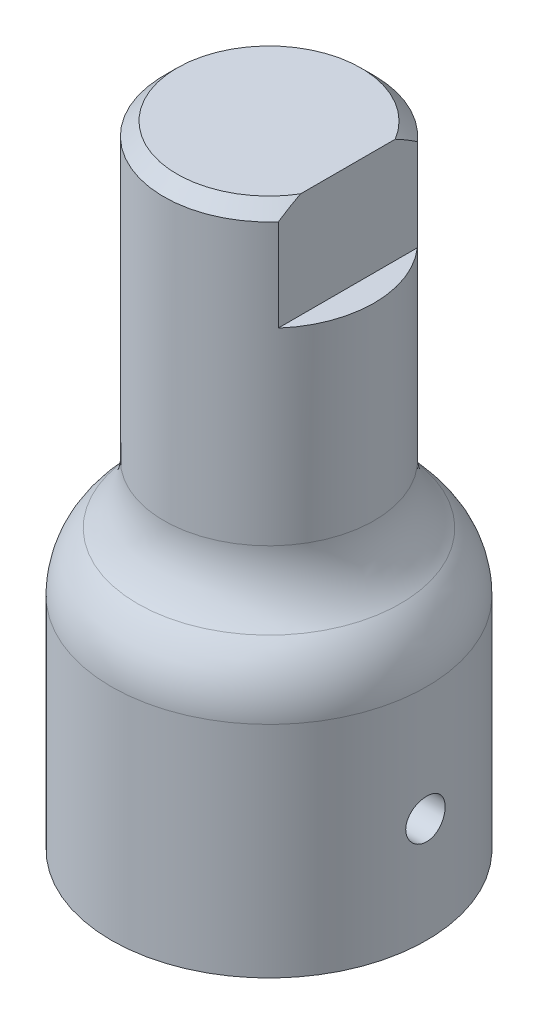
ISO-10303-21;
HEADER;
FILE_DESCRIPTION(('STEP AP214'),'2;1');
FILE_NAME('part.step','',(''),(''),'','','');
FILE_SCHEMA(('AUTOMOTIVE_DESIGN { 1 0 10303 214 1 1 1 1 }'));
ENDSEC;
DATA;
#1=APPLICATION_CONTEXT('core data for automotive mechanical design processes');
#2=APPLICATION_PROTOCOL_DEFINITION('international standard','automotive_design',2000,#1);
#3=PRODUCT_CONTEXT('',#1,'mechanical');
#4=PRODUCT('Part','Part','',(#3));
#5=PRODUCT_RELATED_PRODUCT_CATEGORY('part','',(#4));
#6=PRODUCT_DEFINITION_FORMATION('','',#4);
#7=PRODUCT_DEFINITION_CONTEXT('part definition',#1,'design');
#8=PRODUCT_DEFINITION('design','',#6,#7);
#9=PRODUCT_DEFINITION_SHAPE('','',#8);
#10=(LENGTH_UNIT() NAMED_UNIT(*) SI_UNIT(.MILLI.,.METRE.));
#11=(NAMED_UNIT(*) PLANE_ANGLE_UNIT() SI_UNIT($,.RADIAN.));
#12=(NAMED_UNIT(*) SI_UNIT($,.STERADIAN.) SOLID_ANGLE_UNIT());
#13=UNCERTAINTY_MEASURE_WITH_UNIT(LENGTH_MEASURE(1.E-05),#10,'distance_accuracy_value','');
#14=(GEOMETRIC_REPRESENTATION_CONTEXT(3) GLOBAL_UNCERTAINTY_ASSIGNED_CONTEXT((#13)) GLOBAL_UNIT_ASSIGNED_CONTEXT((#10,
#11,#12)) REPRESENTATION_CONTEXT('',''));
#15=CARTESIAN_POINT('',(0.,0.,0.));
#16=DIRECTION('',(0.,0.,1.));
#17=DIRECTION('',(1.,0.,0.));
#18=AXIS2_PLACEMENT_3D('',#15,#16,#17);
#19=CARTESIAN_POINT('',(0.,38.1,0.));
#20=DIRECTION('',(0.,-1.,0.));
#21=DIRECTION('',(0.,0.,-1.));
#22=AXIS2_PLACEMENT_3D('',#19,#20,#21);
#23=CYLINDRICAL_SURFACE('',#22,6.35);
#24=CARTESIAN_POINT('',(0.,20.3651280605346,0.));
#25=DIRECTION('',(0.,-1.,0.));
#26=DIRECTION('',(0.,0.,-1.));
#27=AXIS2_PLACEMENT_3D('',#24,#25,#26);
#28=CIRCLE('',#27,6.35);
#29=CARTESIAN_POINT('',(0.,20.3651280605346,-6.35));
#30=VERTEX_POINT('',#29);
#31=EDGE_CURVE('E151',#30,#30,#28,.F.);
#32=ORIENTED_EDGE('',*,*,#31,.T.);
#33=EDGE_LOOP('',(#32));
#34=FACE_BOUND('',#33,.T.);
#35=DIRECTION('',(0.,1.,0.));
#36=VECTOR('',#35,1.);
#37=CARTESIAN_POINT('',(4.7625,31.75,4.20013020631504));
#38=LINE('',#37,#36);
#39=CARTESIAN_POINT('',(4.7625,31.75,4.20013020631504));
#40=VERTEX_POINT('',#39);
#41=CARTESIAN_POINT('',(4.7625,37.30625,4.20013020631504));
#42=VERTEX_POINT('',#41);
#43=EDGE_CURVE('E84',#40,#42,#38,.T.);
#44=ORIENTED_EDGE('',*,*,#43,.T.);
#45=CARTESIAN_POINT('',(0.,37.30625,0.));
#46=DIRECTION('',(0.,1.,0.));
#47=DIRECTION('',(0.,0.,1.));
#48=AXIS2_PLACEMENT_3D('',#45,#46,#47);
#49=CIRCLE('',#48,6.35);
#50=CARTESIAN_POINT('',(4.76249999999999,37.30625,-4.20013020631504));
#51=VERTEX_POINT('',#50);
#52=EDGE_CURVE('E11',#42,#51,#49,.F.);
#53=ORIENTED_EDGE('',*,*,#52,.T.);
#54=DIRECTION('',(0.,1.,0.));
#55=VECTOR('',#54,1.);
#56=CARTESIAN_POINT('',(4.7625,31.75,-4.20013020631504));
#57=LINE('',#56,#55);
#58=CARTESIAN_POINT('',(4.7625,31.75,-4.20013020631504));
#59=VERTEX_POINT('',#58);
#60=EDGE_CURVE('E82',#59,#51,#57,.T.);
#61=ORIENTED_EDGE('',*,*,#60,.F.);
#62=CARTESIAN_POINT('',(0.,31.75,0.));
#63=DIRECTION('',(0.,1.,0.));
#64=DIRECTION('',(0.,0.,1.));
#65=AXIS2_PLACEMENT_3D('',#62,#63,#64);
#66=CIRCLE('',#65,6.35);
#67=EDGE_CURVE('E87',#40,#59,#66,.T.);
#68=ORIENTED_EDGE('',*,*,#67,.F.);
#69=EDGE_LOOP('',(#44,#53,#61,#68));
#70=FACE_BOUND('',#69,.T.);
#71=ADVANCED_FACE('F37',(#34,#70),#23,.T.);
#72=CARTESIAN_POINT('',(0.,38.1,0.));
#73=DIRECTION('',(0.,1.,0.));
#74=DIRECTION('',(0.,0.,1.));
#75=AXIS2_PLACEMENT_3D('',#72,#73,#74);
#76=PLANE('',#75);
#77=DIRECTION('',(0.,0.,-1.));
#78=VECTOR('',#77,1.);
#79=CARTESIAN_POINT('',(4.7625,38.1,4.20013020631504));
#80=LINE('',#79,#78);
#81=CARTESIAN_POINT('',(4.7625,38.1,2.86190632489951));
#82=VERTEX_POINT('',#81);
#83=CARTESIAN_POINT('',(4.7625,38.1,-2.86190632489954));
#84=VERTEX_POINT('',#83);
#85=EDGE_CURVE('E90',#82,#84,#80,.T.);
#86=ORIENTED_EDGE('',*,*,#85,.T.);
#87=CARTESIAN_POINT('',(0.,38.1,0.));
#88=DIRECTION('',(0.,1.,0.));
#89=DIRECTION('',(0.,0.,1.));
#90=AXIS2_PLACEMENT_3D('',#87,#88,#89);
#91=CIRCLE('',#90,5.55624999999999);
#92=EDGE_CURVE('E167',#84,#82,#91,.T.);
#93=ORIENTED_EDGE('',*,*,#92,.T.);
#94=EDGE_LOOP('',(#86,#93));
#95=FACE_BOUND('',#94,.T.);
#96=ADVANCED_FACE('F143',(#95),#76,.T.);
#97=CARTESIAN_POINT('',(0.,0.,0.));
#98=DIRECTION('',(0.,1.,0.));
#99=DIRECTION('',(0.,0.,1.));
#100=AXIS2_PLACEMENT_3D('',#97,#98,#99);
#101=PLANE('',#100);
#102=CARTESIAN_POINT('',(0.,0.,0.));
#103=DIRECTION('',(0.,1.,0.));
#104=DIRECTION('',(0.,0.,1.));
#105=AXIS2_PLACEMENT_3D('',#102,#103,#104);
#106=CIRCLE('',#105,9.525);
#107=CARTESIAN_POINT('',(0.,0.,9.525));
#108=VERTEX_POINT('',#107);
#109=EDGE_CURVE('E154',#108,#108,#106,.T.);
#110=ORIENTED_EDGE('',*,*,#109,.F.);
#111=EDGE_LOOP('',(#110));
#112=FACE_BOUND('',#111,.T.);
#113=CARTESIAN_POINT('',(0.,0.,0.));
#114=DIRECTION('',(0.,1.,0.));
#115=DIRECTION('',(0.,0.,1.));
#116=AXIS2_PLACEMENT_3D('',#113,#114,#115);
#117=CIRCLE('',#116,6.35);
#118=CARTESIAN_POINT('',(4.76250000000001,0.,-4.20013020631506));
#119=VERTEX_POINT('',#118);
#120=CARTESIAN_POINT('',(4.7625,0.,4.20013020631504));
#121=VERTEX_POINT('',#120);
#122=EDGE_CURVE('E105',#119,#121,#117,.T.);
#123=ORIENTED_EDGE('',*,*,#122,.T.);
#124=DIRECTION('',(0.,0.,-1.));
#125=VECTOR('',#124,1.);
#126=CARTESIAN_POINT('',(4.7625,0.,4.20013020631504));
#127=LINE('',#126,#125);
#128=EDGE_CURVE('E241',#121,#119,#127,.T.);
#129=ORIENTED_EDGE('',*,*,#128,.T.);
#130=EDGE_LOOP('',(#123,#129));
#131=FACE_BOUND('',#130,.T.);
#132=ADVANCED_FACE('F140',(#112,#131),#101,.F.);
#133=CARTESIAN_POINT('',(0.,15.875,0.));
#134=DIRECTION('',(0.,-1.,0.));
#135=DIRECTION('',(0.,0.,-1.));
#136=AXIS2_PLACEMENT_3D('',#133,#134,#135);
#137=CYLINDRICAL_SURFACE('',#136,9.525);
#138=CARTESIAN_POINT('',(9.52500000000001,5.15937499999999,0.));
#139=CARTESIAN_POINT('',(9.52499907081925,5.15937782937063,0.0665993217584231));
#140=CARTESIAN_POINT('',(9.52429412394272,5.16498183370436,0.133240259761677));
#141=CARTESIAN_POINT('',(9.52154975978035,5.18724884311434,0.264667746995242));
#142=CARTESIAN_POINT('',(9.51950894913981,5.20392339543602,0.329452286209556));
#143=CARTESIAN_POINT('',(9.51432276572399,5.2478325529141,0.455245267504717));
#144=CARTESIAN_POINT('',(9.51117813655702,5.27506005016195,0.516256219269601));
#145=CARTESIAN_POINT('',(9.50413406293194,5.33928666899061,0.632831224917814));
#146=CARTESIAN_POINT('',(9.50023474798811,5.37628411431275,0.688396210941228));
#147=CARTESIAN_POINT('',(9.49209265522138,5.45921816611111,0.792819479063542));
#148=CARTESIAN_POINT('',(9.48784828372264,5.50519780785115,0.841643461301304));
#149=CARTESIAN_POINT('',(9.47950729512144,5.60469866970933,0.930903392931754));
#150=CARTESIAN_POINT('',(9.47541068555933,5.65822027401493,0.971338914756813));
#151=CARTESIAN_POINT('',(9.46781335551327,5.77150863931565,1.04280183931148));
#152=CARTESIAN_POINT('',(9.4643146875598,5.83129581844674,1.07379711069193));
#153=CARTESIAN_POINT('',(9.45833037427971,5.95527783348994,1.12529449021889));
#154=CARTESIAN_POINT('',(9.45584469053881,6.01947250215377,1.14579699627856));
#155=CARTESIAN_POINT('',(9.45218299236221,6.1500912981482,1.17562263923679));
#156=CARTESIAN_POINT('',(9.4510001961175,6.21650200898162,1.18500368539096));
#157=CARTESIAN_POINT('',(9.45005743403005,6.34996488297846,1.19249930547662));
#158=CARTESIAN_POINT('',(9.45029741096968,6.41701702023827,1.1906143324774));
#159=CARTESIAN_POINT('',(9.45216687494844,6.54945579897722,1.17567895885832));
#160=CARTESIAN_POINT('',(9.45378842328606,6.61484976217787,1.16269234837145));
#161=CARTESIAN_POINT('',(9.45822593884571,6.74252287885554,1.12602186999044));
#162=CARTESIAN_POINT('',(9.46104193026777,6.80480196919507,1.10233778535935));
#163=CARTESIAN_POINT('',(9.46756003930541,6.92467563453408,1.04487609790793));
#164=CARTESIAN_POINT('',(9.4712645849195,6.98225678424357,1.01107077457825));
#165=CARTESIAN_POINT('',(9.47914051318822,7.09095293821431,0.934346049828843));
#166=CARTESIAN_POINT('',(9.48331191719173,7.14206764654497,0.891426231533467));
#167=CARTESIAN_POINT('',(9.49168683585316,7.23675021598171,0.797337326496488));
#168=CARTESIAN_POINT('',(9.49589037311757,7.28026345495354,0.746113256233798));
#169=CARTESIAN_POINT('',(9.50382893754725,7.35808260411454,0.637059226790497));
#170=CARTESIAN_POINT('',(9.50756396363217,7.39238849307254,0.579229252377816));
#171=CARTESIAN_POINT('',(9.51414698744099,7.45081916637094,0.45856287098686));
#172=CARTESIAN_POINT('',(9.51699468708732,7.47494053041093,0.395724790529586));
#173=CARTESIAN_POINT('',(9.52147949227755,7.51227407254044,0.266846656630284));
#174=CARTESIAN_POINT('',(9.52311665449634,7.52548676135526,0.200806753245347));
#175=CARTESIAN_POINT('',(9.52498855290626,7.54055709830408,0.0678718943137941));
#176=CARTESIAN_POINT('',(9.5252325821293,7.54248999136338,0.000985594707077859));
#177=CARTESIAN_POINT('',(9.52431580975086,7.53514444165585,-0.132157487381941));
#178=CARTESIAN_POINT('',(9.52315503806675,7.52586623764643,-0.1984142832402));
#179=CARTESIAN_POINT('',(9.51956488620376,7.4964243761962,-0.328195546802384));
#180=CARTESIAN_POINT('',(9.51713968812605,7.47629659642949,-0.391728279164775));
#181=CARTESIAN_POINT('',(9.51129220626469,7.42576423852647,-0.514516523126327));
#182=CARTESIAN_POINT('',(9.50786988862573,7.39535931144345,-0.573771889410369));
#183=CARTESIAN_POINT('',(9.50038655660942,7.32495369326207,-0.686659402977398));
#184=CARTESIAN_POINT('',(9.49632233975245,7.28490432948006,-0.740260978173252));
#185=CARTESIAN_POINT('',(9.48801986532594,7.19641555179934,-0.840008316309537));
#186=CARTESIAN_POINT('',(9.48378160085311,7.14797580486547,-0.88615378315793));
#187=CARTESIAN_POINT('',(9.47558003976556,7.04374984276942,-0.969945970387084));
#188=CARTESIAN_POINT('',(9.47161844586032,6.98792337506968,-1.00754281309548));
#189=CARTESIAN_POINT('',(9.46444677006442,6.87070401088794,-1.07282593859748));
#190=CARTESIAN_POINT('',(9.46123667310902,6.8093112260243,-1.10051242006314));
#191=CARTESIAN_POINT('',(9.45594303749664,6.68286287925595,-1.14510815818519));
#192=CARTESIAN_POINT('',(9.45385656144255,6.61781736343965,-1.16204553632646));
#193=CARTESIAN_POINT('',(9.45103797450925,6.48577769209946,-1.18475283457957));
#194=CARTESIAN_POINT('',(9.4503058006243,6.41878362737453,-1.19052327420766));
#195=CARTESIAN_POINT('',(9.45028055162894,6.28524479746628,-1.19072336281041));
#196=CARTESIAN_POINT('',(9.45097753288118,6.21870013798194,-1.18523137240429));
#197=CARTESIAN_POINT('',(9.45371068298342,6.08748760464941,-1.1632284353095));
#198=CARTESIAN_POINT('',(9.45574685197692,6.02281973100231,-1.14671748744012));
#199=CARTESIAN_POINT('',(9.46092587637629,5.89720676184,-1.1031698188447));
#200=CARTESIAN_POINT('',(9.46406833493563,5.83626034055836,-1.07613687218742));
#201=CARTESIAN_POINT('',(9.47110651770345,5.71975615600949,-1.0123202871491));
#202=CARTESIAN_POINT('',(9.47500225135022,5.66419846027432,-0.975536526591441));
#203=CARTESIAN_POINT('',(9.48314050513251,5.55964825393161,-0.892971765265352));
#204=CARTESIAN_POINT('',(9.48738516580021,5.51070202422019,-0.847132366775329));
#205=CARTESIAN_POINT('',(9.49572411046118,5.42116637451374,-0.747879295593699));
#206=CARTESIAN_POINT('',(9.4998183587625,5.38057892761873,-0.694463839578671));
#207=CARTESIAN_POINT('',(9.50741235699438,5.3087815986786,-0.581342001931816));
#208=CARTESIAN_POINT('',(9.51090978693541,5.27760796494047,-0.521612469407681));
#209=CARTESIAN_POINT('',(9.51689255372791,5.22577794556112,-0.397755857220997));
#210=CARTESIAN_POINT('',(9.51937898969762,5.20511013219917,-0.333633642264462));
#211=CARTESIAN_POINT('',(9.5224602555609,5.17982549019592,-0.224316498899738));
#212=CARTESIAN_POINT('',(9.5234080195771,5.17216757888104,-0.179810884749947));
#213=CARTESIAN_POINT('',(9.52467820420526,5.16194139423859,-0.0902098763549346));
#214=CARTESIAN_POINT('',(9.52500062942853,5.15937308337983,-0.0451144864612445));
#215=CARTESIAN_POINT('',(9.52500000000001,5.15937499999999,0.));
#216=B_SPLINE_CURVE_WITH_KNOTS('',3,(#138,#139,#140,#141,#142,#143,#144,#145,#146,#147,#148,
#149,#150,#151,#152,#153,#154,#155,#156,#157,#158,#159,#160,#161,#162,#163,#164,#165,#166,#167,
#168,#169,#170,#171,#172,#173,#174,#175,#176,#177,#178,#179,#180,#181,#182,#183,#184,#185,#186,
#187,#188,#189,#190,#191,#192,#193,#194,#195,#196,#197,#198,#199,#200,#201,#202,#203,#204,#205,
#206,#207,#208,#209,#210,#211,#212,#213,#214,#215),.UNSPECIFIED.,.T.,.F.,(4,2,2,2,2,2,2,2,2,2,2,
2,2,2,2,2,2,2,2,2,2,2,2,2,2,2,2,2,2,2,2,2,2,2,2,2,2,2,4),(0.,0.199633176159693,
0.399474909524322,0.599182273271584,0.7988553948775,0.999509747873788,1.20017432589756,
1.40151445464363,1.60284694747855,1.80312643542611,2.00339786907571,2.20252621680356,
2.40165859916673,2.60134144268486,2.80103342119622,3.00210606462469,3.2031791717012,
3.40431975217177,3.60545091505426,3.80523883060403,4.00502249144044,4.20414951916731,
4.4032833086635,4.60344394394661,4.80361252592385,5.00492063930482,5.20622471685509,
5.40699995376291,5.60776584983809,5.80713961697555,6.00651340547636,6.20581574766465,
6.40512058720716,6.60575531950735,6.80643735771345,7.00788255696302,7.20910816248271,
7.34434099068108,7.47957282165583),.UNSPECIFIED.);
#217=CARTESIAN_POINT('',(9.52500000000001,5.15937499999999,0.));
#218=VERTEX_POINT('',#217);
#219=EDGE_CURVE('E98',#218,#218,#216,.T.);
#220=ORIENTED_EDGE('',*,*,#219,.T.);
#221=EDGE_LOOP('',(#220));
#222=FACE_BOUND('',#221,.T.);
#223=CARTESIAN_POINT('',(0.,13.2656122319728,0.));
#224=DIRECTION('',(0.,-1.,0.));
#225=DIRECTION('',(0.,0.,-1.));
#226=AXIS2_PLACEMENT_3D('',#223,#224,#225);
#227=CIRCLE('',#226,9.525);
#228=CARTESIAN_POINT('',(0.,13.2656122319728,-9.525));
#229=VERTEX_POINT('',#228);
#230=EDGE_CURVE('E157',#229,#229,#227,.T.);
#231=ORIENTED_EDGE('',*,*,#230,.T.);
#232=EDGE_LOOP('',(#231));
#233=FACE_BOUND('',#232,.T.);
#234=ORIENTED_EDGE('',*,*,#109,.T.);
#235=EDGE_LOOP('',(#234));
#236=FACE_BOUND('',#235,.T.);
#237=ADVANCED_FACE('F107',(#222,#233,#236),#137,.T.);
#238=CARTESIAN_POINT('',(0.,12.7,0.));
#239=DIRECTION('',(0.,-1.,0.));
#240=DIRECTION('',(0.,0.,-1.));
#241=AXIS2_PLACEMENT_3D('',#238,#239,#240);
#242=CYLINDRICAL_SURFACE('',#241,6.35);
#243=ORIENTED_EDGE('',*,*,#122,.F.);
#244=DIRECTION('',(0.,-1.,0.));
#245=VECTOR('',#244,1.);
#246=CARTESIAN_POINT('',(4.7625,12.7,-4.20013020631504));
#247=LINE('',#246,#245);
#248=CARTESIAN_POINT('',(4.7625,12.7,-4.20013020631504));
#249=VERTEX_POINT('',#248);
#250=EDGE_CURVE('E252',#249,#119,#247,.T.);
#251=ORIENTED_EDGE('',*,*,#250,.F.);
#252=CARTESIAN_POINT('',(0.,12.7,0.));
#253=DIRECTION('',(0.,1.,0.));
#254=DIRECTION('',(0.,0.,1.));
#255=AXIS2_PLACEMENT_3D('',#252,#253,#254);
#256=CIRCLE('',#255,6.35);
#257=CARTESIAN_POINT('',(4.7625,12.7,4.20013020631503));
#258=VERTEX_POINT('',#257);
#259=EDGE_CURVE('E244',#249,#258,#256,.T.);
#260=ORIENTED_EDGE('',*,*,#259,.T.);
#261=DIRECTION('',(0.,-1.,0.));
#262=VECTOR('',#261,1.);
#263=CARTESIAN_POINT('',(4.7625,12.7,4.20013020631503));
#264=LINE('',#263,#262);
#265=EDGE_CURVE('E160',#258,#121,#264,.T.);
#266=ORIENTED_EDGE('',*,*,#265,.T.);
#267=EDGE_LOOP('',(#243,#251,#260,#266));
#268=FACE_BOUND('',#267,.T.);
#269=ADVANCED_FACE('F133',(#268),#242,.F.);
#270=CARTESIAN_POINT('',(4.7625,12.7,4.20013020631503));
#271=DIRECTION('',(-1.,0.,0.));
#272=DIRECTION('',(0.,0.,1.));
#273=AXIS2_PLACEMENT_3D('',#270,#271,#272);
#274=PLANE('',#273);
#275=CARTESIAN_POINT('',(4.7625,6.34999999999999,0.));
#276=DIRECTION('',(-1.,0.,0.));
#277=DIRECTION('',(0.,0.,1.));
#278=AXIS2_PLACEMENT_3D('',#275,#276,#277);
#279=CIRCLE('',#278,1.190625);
#280=CARTESIAN_POINT('',(4.7625,6.34999999999999,1.19062499999999));
#281=VERTEX_POINT('',#280);
#282=EDGE_CURVE('E93',#281,#281,#279,.T.);
#283=ORIENTED_EDGE('',*,*,#282,.F.);
#284=EDGE_LOOP('',(#283));
#285=FACE_BOUND('',#284,.T.);
#286=ORIENTED_EDGE('',*,*,#128,.F.);
#287=ORIENTED_EDGE('',*,*,#265,.F.);
#288=DIRECTION('',(0.,0.,-1.));
#289=VECTOR('',#288,1.);
#290=CARTESIAN_POINT('',(4.7625,12.7,4.20013020631503));
#291=LINE('',#290,#289);
#292=EDGE_CURVE('E248',#258,#249,#291,.T.);
#293=ORIENTED_EDGE('',*,*,#292,.T.);
#294=ORIENTED_EDGE('',*,*,#250,.T.);
#295=EDGE_LOOP('',(#286,#287,#293,#294));
#296=FACE_BOUND('',#295,.T.);
#297=ADVANCED_FACE('F130',(#285,#296),#274,.T.);
#298=CARTESIAN_POINT('',(0.,12.7,0.));
#299=DIRECTION('',(0.,1.,0.));
#300=DIRECTION('',(0.,0.,1.));
#301=AXIS2_PLACEMENT_3D('',#298,#299,#300);
#302=PLANE('',#301);
#303=ORIENTED_EDGE('',*,*,#259,.F.);
#304=ORIENTED_EDGE('',*,*,#292,.F.);
#305=EDGE_LOOP('',(#303,#304));
#306=FACE_BOUND('',#305,.T.);
#307=ADVANCED_FACE('F126',(#306),#302,.F.);
#308=CARTESIAN_POINT('',(0.,20.3651280605346,0.));
#309=DIRECTION('',(0.,-1.,0.));
#310=DIRECTION('',(0.,0.,-1.));
#311=AXIS2_PLACEMENT_3D('',#308,#309,#310);
#312=TOROIDAL_SURFACE('',#311,11.1125,4.7625);
#313=CARTESIAN_POINT('',(0.,16.8153701462536,0.));
#314=DIRECTION('',(0.,1.,0.));
#315=DIRECTION('',(0.,0.,1.));
#316=AXIS2_PLACEMENT_3D('',#313,#314,#315);
#317=CIRCLE('',#316,7.9375);
#318=CARTESIAN_POINT('',(0.,16.8153701462536,7.9375));
#319=VERTEX_POINT('',#318);
#320=EDGE_CURVE('E153',#319,#319,#317,.T.);
#321=ORIENTED_EDGE('',*,*,#320,.T.);
#322=EDGE_LOOP('',(#321));
#323=FACE_BOUND('',#322,.T.);
#324=ORIENTED_EDGE('',*,*,#31,.F.);
#325=EDGE_LOOP('',(#324));
#326=FACE_BOUND('',#325,.T.);
#327=ADVANCED_FACE('F122',(#323,#326),#312,.F.);
#328=CARTESIAN_POINT('',(0.,13.2656122319728,0.));
#329=DIRECTION('',(0.,-1.,0.));
#330=DIRECTION('',(0.,0.,-1.));
#331=AXIS2_PLACEMENT_3D('',#328,#329,#330);
#332=DEGENERATE_TOROIDAL_SURFACE('',#331,4.7625,4.7625,.T.);
#333=ORIENTED_EDGE('',*,*,#230,.F.);
#334=EDGE_LOOP('',(#333));
#335=FACE_BOUND('',#334,.T.);
#336=ORIENTED_EDGE('',*,*,#320,.F.);
#337=EDGE_LOOP('',(#336));
#338=FACE_BOUND('',#337,.T.);
#339=ADVANCED_FACE('F116',(#335,#338),#332,.T.);
#340=CARTESIAN_POINT('',(9.52500000000001,6.34999999999999,0.));
#341=DIRECTION('',(-1.,0.,0.));
#342=DIRECTION('',(0.,0.,1.));
#343=AXIS2_PLACEMENT_3D('',#340,#341,#342);
#344=CYLINDRICAL_SURFACE('',#343,1.190625);
#345=ORIENTED_EDGE('',*,*,#282,.T.);
#346=EDGE_LOOP('',(#345));
#347=FACE_BOUND('',#346,.T.);
#348=ORIENTED_EDGE('',*,*,#219,.F.);
#349=EDGE_LOOP('',(#348));
#350=FACE_BOUND('',#349,.T.);
#351=ADVANCED_FACE('F111',(#347,#350),#344,.F.);
#352=CARTESIAN_POINT('',(4.7625,31.75,4.20013020631504));
#353=DIRECTION('',(1.,0.,0.));
#354=DIRECTION('',(0.,0.,-1.));
#355=AXIS2_PLACEMENT_3D('',#352,#353,#354);
#356=PLANE('',#355);
#357=ORIENTED_EDGE('',*,*,#85,.F.);
#358=CARTESIAN_POINT('',(4.7625,38.1,2.86190632489951));
#359=CARTESIAN_POINT('',(4.7625,38.0405523803319,2.97728473468103));
#360=CARTESIAN_POINT('',(4.7625,37.9790569609474,3.09158529699657));
#361=CARTESIAN_POINT('',(4.7625,37.8525824129198,3.31813666600112));
#362=CARTESIAN_POINT('',(4.7625,37.7876058580941,3.43038890701487));
#363=CARTESIAN_POINT('',(4.7625,37.6547025930422,3.65310051616839));
#364=CARTESIAN_POINT('',(4.7625,37.5867763300089,3.76356015261344));
#365=CARTESIAN_POINT('',(4.7625,37.4483372325312,3.98296117478161));
#366=CARTESIAN_POINT('',(4.7625,37.3778225485784,4.09190139499944));
#367=CARTESIAN_POINT('',(4.7625,37.30625,4.20013020631504));
#368=B_SPLINE_CURVE_WITH_KNOTS('',3,(#358,#359,#360,#361,#362,#363,#364,#365,#366,#367),
.UNSPECIFIED.,.F.,.F.,(4,2,2,2,4),(0.,0.389329079905572,0.778374174152333,1.16736049142069,
1.55663037919006),.UNSPECIFIED.);
#369=EDGE_CURVE('E44',#82,#42,#368,.T.);
#370=ORIENTED_EDGE('',*,*,#369,.T.);
#371=ORIENTED_EDGE('',*,*,#43,.F.);
#372=DIRECTION('',(0.,0.,-1.));
#373=VECTOR('',#372,1.);
#374=CARTESIAN_POINT('',(4.7625,31.75,4.20013020631504));
#375=LINE('',#374,#373);
#376=EDGE_CURVE('E79',#40,#59,#375,.T.);
#377=ORIENTED_EDGE('',*,*,#376,.T.);
#378=ORIENTED_EDGE('',*,*,#60,.T.);
#379=CARTESIAN_POINT('',(4.76249999999999,37.30625,-4.20013020631504));
#380=CARTESIAN_POINT('',(4.7625,37.3778225485784,-4.09190139499943));
#381=CARTESIAN_POINT('',(4.7625,37.4483372325312,-3.9829611747816));
#382=CARTESIAN_POINT('',(4.7625,37.5867763300089,-3.76356015261343));
#383=CARTESIAN_POINT('',(4.7625,37.6547025930422,-3.65310051616839));
#384=CARTESIAN_POINT('',(4.7625,37.7876058580941,-3.43038890701487));
#385=CARTESIAN_POINT('',(4.7625,37.8525824129198,-3.31813666600112));
#386=CARTESIAN_POINT('',(4.7625,37.9790569609474,-3.09158529699656));
#387=CARTESIAN_POINT('',(4.7625,38.0405523803319,-2.97728473468102));
#388=CARTESIAN_POINT('',(4.7625,38.1,-2.86190632489951));
#389=B_SPLINE_CURVE_WITH_KNOTS('',3,(#379,#380,#381,#382,#383,#384,#385,#386,#387,#388),
.UNSPECIFIED.,.F.,.F.,(4,2,2,2,4),(0.,0.389269887769373,0.778256205037732,1.16730129928449,
1.55663037919006),.UNSPECIFIED.);
#390=EDGE_CURVE('E170',#51,#84,#389,.T.);
#391=ORIENTED_EDGE('',*,*,#390,.T.);
#392=EDGE_LOOP('',(#357,#370,#371,#377,#378,#391));
#393=FACE_BOUND('',#392,.T.);
#394=ADVANCED_FACE('F81',(#393),#356,.T.);
#395=CARTESIAN_POINT('',(0.,31.75,0.));
#396=DIRECTION('',(0.,1.,0.));
#397=DIRECTION('',(0.,0.,1.));
#398=AXIS2_PLACEMENT_3D('',#395,#396,#397);
#399=PLANE('',#398);
#400=ORIENTED_EDGE('',*,*,#67,.T.);
#401=ORIENTED_EDGE('',*,*,#376,.F.);
#402=EDGE_LOOP('',(#400,#401));
#403=FACE_BOUND('',#402,.T.);
#404=ADVANCED_FACE('F89',(#403),#399,.T.);
#405=CARTESIAN_POINT('',(0.,38.1,0.));
#406=DIRECTION('',(0.,-1.,0.));
#407=DIRECTION('',(0.,0.,-1.));
#408=AXIS2_PLACEMENT_3D('',#405,#406,#407);
#409=CONICAL_SURFACE('',#408,5.55624999999999,0.785398163397455);
#410=ORIENTED_EDGE('',*,*,#390,.F.);
#411=ORIENTED_EDGE('',*,*,#52,.F.);
#412=ORIENTED_EDGE('',*,*,#369,.F.);
#413=ORIENTED_EDGE('',*,*,#92,.F.);
#414=EDGE_LOOP('',(#410,#411,#412,#413));
#415=FACE_BOUND('',#414,.T.);
#416=ADVANCED_FACE('F178',(#415),#409,.T.);
#417=CLOSED_SHELL('',(#71,#96,#132,#237,#269,#297,#307,#327,#339,#351,#394,#404,#416));
#418=MANIFOLD_SOLID_BREP('B2',#417);
#419=ADVANCED_BREP_SHAPE_REPRESENTATION('',(#18,#418),#14);
#420=SHAPE_DEFINITION_REPRESENTATION(#9,#419);
ENDSEC;
END-ISO-10303-21;
